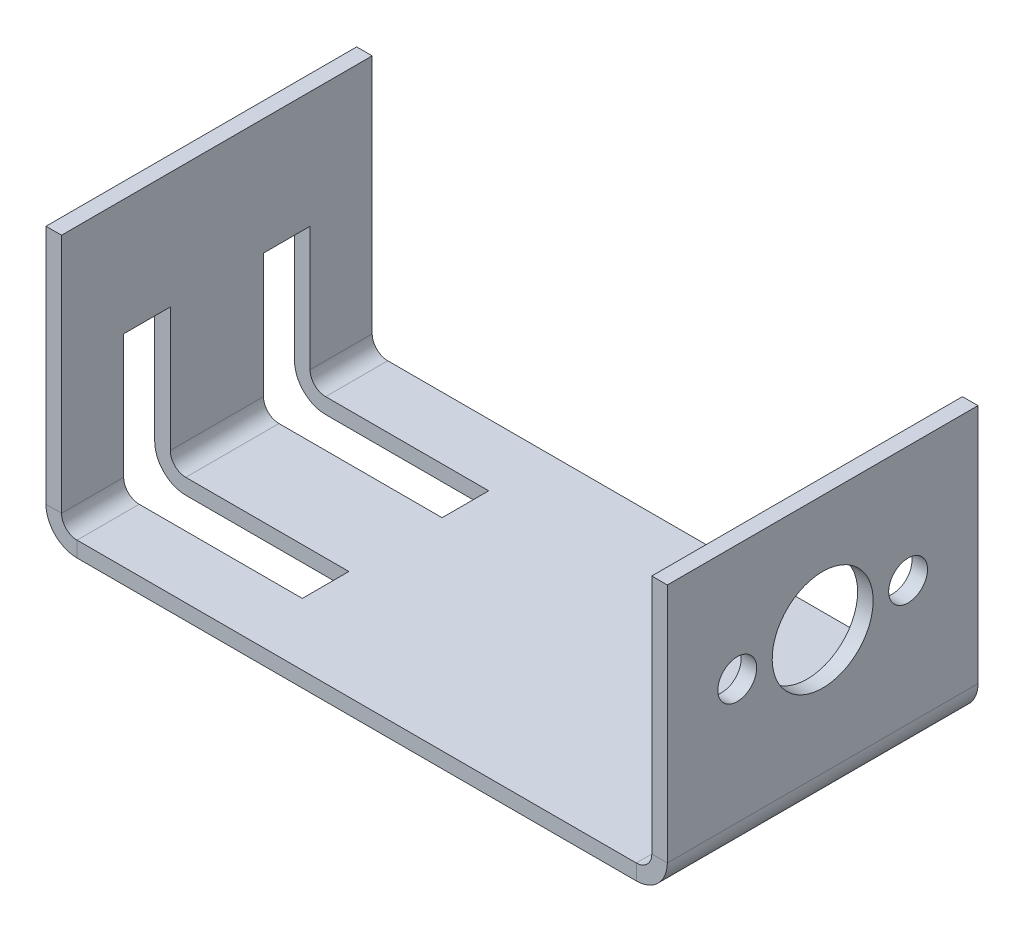
ISO-10303-21;
HEADER;
FILE_DESCRIPTION(('STEP AP214'),'2;1');
FILE_NAME('part.step','',(''),(''),'','','');
FILE_SCHEMA(('AUTOMOTIVE_DESIGN { 1 0 10303 214 1 1 1 1 }'));
ENDSEC;
DATA;
#1=APPLICATION_CONTEXT('core data for automotive mechanical design processes');
#2=APPLICATION_PROTOCOL_DEFINITION('international standard','automotive_design',2000,#1);
#3=PRODUCT_CONTEXT('',#1,'mechanical');
#4=PRODUCT('Part','Part','',(#3));
#5=PRODUCT_RELATED_PRODUCT_CATEGORY('part','',(#4));
#6=PRODUCT_DEFINITION_FORMATION('','',#4);
#7=PRODUCT_DEFINITION_CONTEXT('part definition',#1,'design');
#8=PRODUCT_DEFINITION('design','',#6,#7);
#9=PRODUCT_DEFINITION_SHAPE('','',#8);
#10=(LENGTH_UNIT() NAMED_UNIT(*) SI_UNIT(.MILLI.,.METRE.));
#11=(NAMED_UNIT(*) PLANE_ANGLE_UNIT() SI_UNIT($,.RADIAN.));
#12=(NAMED_UNIT(*) SI_UNIT($,.STERADIAN.) SOLID_ANGLE_UNIT());
#13=UNCERTAINTY_MEASURE_WITH_UNIT(LENGTH_MEASURE(1.E-05),#10,'distance_accuracy_value','');
#14=(GEOMETRIC_REPRESENTATION_CONTEXT(3) GLOBAL_UNCERTAINTY_ASSIGNED_CONTEXT((#13)) GLOBAL_UNIT_ASSIGNED_CONTEXT((#10,
#11,#12)) REPRESENTATION_CONTEXT('',''));
#15=CARTESIAN_POINT('',(0.,0.,0.));
#16=DIRECTION('',(0.,0.,1.));
#17=DIRECTION('',(1.,0.,0.));
#18=AXIS2_PLACEMENT_3D('',#15,#16,#17);
#19=CARTESIAN_POINT('',(-36.,2.,20.));
#20=DIRECTION('',(0.,0.,1.));
#21=DIRECTION('',(-1.,0.,0.));
#22=AXIS2_PLACEMENT_3D('',#19,#20,#21);
#23=CYLINDRICAL_SURFACE('',#22,4.);
#24=CARTESIAN_POINT('',(-36.,2.,12.));
#25=DIRECTION('',(0.,0.,1.));
#26=DIRECTION('',(1.,0.,0.));
#27=AXIS2_PLACEMENT_3D('',#24,#25,#26);
#28=CIRCLE('',#27,4.);
#29=CARTESIAN_POINT('',(-36.,-2.,12.));
#30=VERTEX_POINT('',#29);
#31=CARTESIAN_POINT('',(-40.,1.99999999999999,12.));
#32=VERTEX_POINT('',#31);
#33=EDGE_CURVE('E349',#30,#32,#28,.F.);
#34=ORIENTED_EDGE('',*,*,#33,.F.);
#35=DIRECTION('',(0.,0.,1.));
#36=VECTOR('',#35,1.);
#37=CARTESIAN_POINT('',(-36.,-2.,20.));
#38=LINE('',#37,#36);
#39=CARTESIAN_POINT('',(-36.,-2.,20.));
#40=VERTEX_POINT('',#39);
#41=EDGE_CURVE('E458',#40,#30,#38,.F.);
#42=ORIENTED_EDGE('',*,*,#41,.F.);
#43=CARTESIAN_POINT('',(-36.,2.,20.));
#44=DIRECTION('',(0.,0.,1.));
#45=DIRECTION('',(1.,0.,0.));
#46=AXIS2_PLACEMENT_3D('',#43,#44,#45);
#47=CIRCLE('',#46,4.);
#48=CARTESIAN_POINT('',(-40.,1.99999999999999,20.));
#49=VERTEX_POINT('',#48);
#50=EDGE_CURVE('E467',#49,#40,#47,.T.);
#51=ORIENTED_EDGE('',*,*,#50,.F.);
#52=DIRECTION('',(0.,0.,1.));
#53=VECTOR('',#52,1.);
#54=CARTESIAN_POINT('',(-40.,1.99999999999999,-20.));
#55=LINE('',#54,#53);
#56=EDGE_CURVE('E444',#49,#32,#55,.F.);
#57=ORIENTED_EDGE('',*,*,#56,.T.);
#58=EDGE_LOOP('',(#34,#42,#51,#57));
#59=FACE_BOUND('',#58,.T.);
#60=ADVANCED_FACE('F83',(#59),#23,.T.);
#61=CARTESIAN_POINT('',(-36.,2.,6.));
#62=DIRECTION('',(0.,0.,-1.));
#63=DIRECTION('',(-1.,0.,0.));
#64=AXIS2_PLACEMENT_3D('',#61,#62,#63);
#65=CIRCLE('',#64,4.);
#66=CARTESIAN_POINT('',(-40.,1.99999999999999,6.));
#67=VERTEX_POINT('',#66);
#68=CARTESIAN_POINT('',(-36.,-2.,6.));
#69=VERTEX_POINT('',#68);
#70=EDGE_CURVE('E339',#67,#69,#65,.F.);
#71=ORIENTED_EDGE('',*,*,#70,.F.);
#72=CARTESIAN_POINT('',(-40.,1.99999999999999,-6.));
#73=VERTEX_POINT('',#72);
#74=EDGE_CURVE('E290',#67,#73,#55,.F.);
#75=ORIENTED_EDGE('',*,*,#74,.T.);
#76=CARTESIAN_POINT('',(-36.,2.,-6.));
#77=DIRECTION('',(0.,0.,1.));
#78=DIRECTION('',(1.,0.,0.));
#79=AXIS2_PLACEMENT_3D('',#76,#77,#78);
#80=CIRCLE('',#79,4.);
#81=CARTESIAN_POINT('',(-36.,-2.,-6.));
#82=VERTEX_POINT('',#81);
#83=EDGE_CURVE('E329',#82,#73,#80,.F.);
#84=ORIENTED_EDGE('',*,*,#83,.F.);
#85=EDGE_CURVE('E462',#69,#82,#38,.F.);
#86=ORIENTED_EDGE('',*,*,#85,.F.);
#87=EDGE_LOOP('',(#71,#75,#84,#86));
#88=FACE_BOUND('',#87,.T.);
#89=ADVANCED_FACE('F600',(#88),#23,.T.);
#90=CARTESIAN_POINT('',(-36.,2.,20.));
#91=DIRECTION('',(0.,0.,1.));
#92=DIRECTION('',(-1.,0.,0.));
#93=AXIS2_PLACEMENT_3D('',#90,#91,#92);
#94=CYLINDRICAL_SURFACE('',#93,2.);
#95=DIRECTION('',(0.,0.,1.));
#96=VECTOR('',#95,1.);
#97=CARTESIAN_POINT('',(-36.,0.,20.));
#98=LINE('',#97,#96);
#99=CARTESIAN_POINT('',(-36.,0.,20.));
#100=VERTEX_POINT('',#99);
#101=CARTESIAN_POINT('',(-36.,0.,12.));
#102=VERTEX_POINT('',#101);
#103=EDGE_CURVE('E473',#100,#102,#98,.F.);
#104=ORIENTED_EDGE('',*,*,#103,.T.);
#105=CARTESIAN_POINT('',(-36.,2.,12.));
#106=DIRECTION('',(0.,0.,1.));
#107=DIRECTION('',(1.,0.,0.));
#108=AXIS2_PLACEMENT_3D('',#105,#106,#107);
#109=CIRCLE('',#108,2.);
#110=CARTESIAN_POINT('',(-38.,1.99999999999999,12.));
#111=VERTEX_POINT('',#110);
#112=EDGE_CURVE('E343',#102,#111,#109,.F.);
#113=ORIENTED_EDGE('',*,*,#112,.T.);
#114=DIRECTION('',(0.,0.,1.));
#115=VECTOR('',#114,1.);
#116=CARTESIAN_POINT('',(-38.,1.99999999999999,-20.));
#117=LINE('',#116,#115);
#118=CARTESIAN_POINT('',(-38.,1.99999999999999,20.));
#119=VERTEX_POINT('',#118);
#120=EDGE_CURVE('E455',#111,#119,#117,.T.);
#121=ORIENTED_EDGE('',*,*,#120,.T.);
#122=CARTESIAN_POINT('',(-36.,2.,20.));
#123=DIRECTION('',(0.,0.,1.));
#124=DIRECTION('',(1.,0.,0.));
#125=AXIS2_PLACEMENT_3D('',#122,#123,#124);
#126=CIRCLE('',#125,2.);
#127=EDGE_CURVE('E426',#119,#100,#126,.T.);
#128=ORIENTED_EDGE('',*,*,#127,.T.);
#129=EDGE_LOOP('',(#104,#113,#121,#128));
#130=FACE_BOUND('',#129,.T.);
#131=ADVANCED_FACE('F549',(#130),#94,.F.);
#132=CARTESIAN_POINT('',(-38.,1.99999999999999,-6.));
#133=VERTEX_POINT('',#132);
#134=CARTESIAN_POINT('',(-38.,1.99999999999999,6.));
#135=VERTEX_POINT('',#134);
#136=EDGE_CURVE('E454',#133,#135,#117,.T.);
#137=ORIENTED_EDGE('',*,*,#136,.T.);
#138=CARTESIAN_POINT('',(-36.,2.,6.));
#139=DIRECTION('',(0.,0.,-1.));
#140=DIRECTION('',(-1.,0.,0.));
#141=AXIS2_PLACEMENT_3D('',#138,#139,#140);
#142=CIRCLE('',#141,2.);
#143=CARTESIAN_POINT('',(-36.,0.,6.));
#144=VERTEX_POINT('',#143);
#145=EDGE_CURVE('E333',#135,#144,#142,.F.);
#146=ORIENTED_EDGE('',*,*,#145,.T.);
#147=CARTESIAN_POINT('',(-36.,0.,-6.));
#148=VERTEX_POINT('',#147);
#149=EDGE_CURVE('E476',#144,#148,#98,.F.);
#150=ORIENTED_EDGE('',*,*,#149,.T.);
#151=CARTESIAN_POINT('',(-36.,2.,-6.));
#152=DIRECTION('',(0.,0.,1.));
#153=DIRECTION('',(1.,0.,0.));
#154=AXIS2_PLACEMENT_3D('',#151,#152,#153);
#155=CIRCLE('',#154,2.);
#156=EDGE_CURVE('E323',#148,#133,#155,.F.);
#157=ORIENTED_EDGE('',*,*,#156,.T.);
#158=EDGE_LOOP('',(#137,#146,#150,#157));
#159=FACE_BOUND('',#158,.T.);
#160=ADVANCED_FACE('F535',(#159),#94,.F.);
#161=CARTESIAN_POINT('',(0.,-2.,0.));
#162=DIRECTION('',(0.,-1.,0.));
#163=DIRECTION('',(0.,0.,-1.));
#164=AXIS2_PLACEMENT_3D('',#161,#162,#163);
#165=PLANE('',#164);
#166=DIRECTION('',(-1.,0.,0.));
#167=VECTOR('',#166,1.);
#168=CARTESIAN_POINT('',(0.,-2.,12.));
#169=LINE('',#168,#167);
#170=CARTESIAN_POINT('',(-15.,-2.,12.));
#171=VERTEX_POINT('',#170);
#172=EDGE_CURVE('E351',#171,#30,#169,.T.);
#173=ORIENTED_EDGE('',*,*,#172,.F.);
#174=DIRECTION('',(0.,0.,1.));
#175=VECTOR('',#174,1.);
#176=CARTESIAN_POINT('',(-15.,-2.,0.));
#177=LINE('',#176,#175);
#178=CARTESIAN_POINT('',(-15.,-2.,6.));
#179=VERTEX_POINT('',#178);
#180=EDGE_CURVE('E356',#179,#171,#177,.T.);
#181=ORIENTED_EDGE('',*,*,#180,.F.);
#182=DIRECTION('',(1.,0.,0.));
#183=VECTOR('',#182,1.);
#184=CARTESIAN_POINT('',(0.,-2.,6.));
#185=LINE('',#184,#183);
#186=EDGE_CURVE('E341',#69,#179,#185,.T.);
#187=ORIENTED_EDGE('',*,*,#186,.F.);
#188=ORIENTED_EDGE('',*,*,#85,.T.);
#189=DIRECTION('',(-1.,0.,0.));
#190=VECTOR('',#189,1.);
#191=CARTESIAN_POINT('',(0.,-2.,-6.));
#192=LINE('',#191,#190);
#193=CARTESIAN_POINT('',(-15.,-2.,-6.));
#194=VERTEX_POINT('',#193);
#195=EDGE_CURVE('E331',#194,#82,#192,.T.);
#196=ORIENTED_EDGE('',*,*,#195,.F.);
#197=DIRECTION('',(0.,0.,-1.));
#198=VECTOR('',#197,1.);
#199=CARTESIAN_POINT('',(-15.,-2.,0.));
#200=LINE('',#199,#198);
#201=CARTESIAN_POINT('',(-15.,-2.,-12.));
#202=VERTEX_POINT('',#201);
#203=EDGE_CURVE('E353',#194,#202,#200,.T.);
#204=ORIENTED_EDGE('',*,*,#203,.T.);
#205=DIRECTION('',(1.,0.,0.));
#206=VECTOR('',#205,1.);
#207=CARTESIAN_POINT('',(0.,-2.,-12.));
#208=LINE('',#207,#206);
#209=CARTESIAN_POINT('',(-36.,-2.,-12.));
#210=VERTEX_POINT('',#209);
#211=EDGE_CURVE('E321',#210,#202,#208,.T.);
#212=ORIENTED_EDGE('',*,*,#211,.F.);
#213=CARTESIAN_POINT('',(-36.,-2.,-20.));
#214=VERTEX_POINT('',#213);
#215=EDGE_CURVE('E463',#210,#214,#38,.F.);
#216=ORIENTED_EDGE('',*,*,#215,.T.);
#217=DIRECTION('',(-1.,0.,0.));
#218=VECTOR('',#217,1.);
#219=CARTESIAN_POINT('',(40.,-2.,-20.));
#220=LINE('',#219,#218);
#221=CARTESIAN_POINT('',(36.,-2.00000000000001,-20.));
#222=VERTEX_POINT('',#221);
#223=EDGE_CURVE('E489',#222,#214,#220,.T.);
#224=ORIENTED_EDGE('',*,*,#223,.F.);
#225=DIRECTION('',(0.,0.,-1.));
#226=VECTOR('',#225,1.);
#227=CARTESIAN_POINT('',(36.,-2.00000000000001,-20.));
#228=LINE('',#227,#226);
#229=CARTESIAN_POINT('',(36.,-2.,20.));
#230=VERTEX_POINT('',#229);
#231=EDGE_CURVE('E400',#222,#230,#228,.F.);
#232=ORIENTED_EDGE('',*,*,#231,.T.);
#233=DIRECTION('',(1.,0.,0.));
#234=VECTOR('',#233,1.);
#235=CARTESIAN_POINT('',(40.,-2.,20.));
#236=LINE('',#235,#234);
#237=EDGE_CURVE('E486',#40,#230,#236,.T.);
#238=ORIENTED_EDGE('',*,*,#237,.F.);
#239=ORIENTED_EDGE('',*,*,#41,.T.);
#240=EDGE_LOOP('',(#173,#181,#187,#188,#196,#204,#212,#216,#224,#232,#238,#239));
#241=FACE_BOUND('',#240,.T.);
#242=ADVANCED_FACE('F580',(#241),#165,.T.);
#243=CARTESIAN_POINT('',(0.,0.,0.));
#244=DIRECTION('',(0.,-1.,0.));
#245=DIRECTION('',(0.,0.,-1.));
#246=AXIS2_PLACEMENT_3D('',#243,#244,#245);
#247=PLANE('',#246);
#248=DIRECTION('',(0.,0.,1.));
#249=VECTOR('',#248,1.);
#250=CARTESIAN_POINT('',(-15.,0.,0.));
#251=LINE('',#250,#249);
#252=CARTESIAN_POINT('',(-15.,0.,6.));
#253=VERTEX_POINT('',#252);
#254=CARTESIAN_POINT('',(-15.,0.,12.));
#255=VERTEX_POINT('',#254);
#256=EDGE_CURVE('E13',#253,#255,#251,.T.);
#257=ORIENTED_EDGE('',*,*,#256,.T.);
#258=DIRECTION('',(-1.,0.,0.));
#259=VECTOR('',#258,1.);
#260=CARTESIAN_POINT('',(0.,0.,12.));
#261=LINE('',#260,#259);
#262=EDGE_CURVE('E346',#255,#102,#261,.T.);
#263=ORIENTED_EDGE('',*,*,#262,.T.);
#264=ORIENTED_EDGE('',*,*,#103,.F.);
#265=DIRECTION('',(1.,0.,0.));
#266=VECTOR('',#265,1.);
#267=CARTESIAN_POINT('',(40.,0.,20.));
#268=LINE('',#267,#266);
#269=CARTESIAN_POINT('',(36.,0.,20.));
#270=VERTEX_POINT('',#269);
#271=EDGE_CURVE('E483',#100,#270,#268,.T.);
#272=ORIENTED_EDGE('',*,*,#271,.T.);
#273=DIRECTION('',(0.,0.,-1.));
#274=VECTOR('',#273,1.);
#275=CARTESIAN_POINT('',(36.,0.,-20.));
#276=LINE('',#275,#274);
#277=CARTESIAN_POINT('',(36.,0.,-20.));
#278=VERTEX_POINT('',#277);
#279=EDGE_CURVE('E413',#278,#270,#276,.F.);
#280=ORIENTED_EDGE('',*,*,#279,.F.);
#281=DIRECTION('',(-1.,0.,0.));
#282=VECTOR('',#281,1.);
#283=CARTESIAN_POINT('',(40.,0.,-20.));
#284=LINE('',#283,#282);
#285=CARTESIAN_POINT('',(-36.,0.,-20.));
#286=VERTEX_POINT('',#285);
#287=EDGE_CURVE('E490',#278,#286,#284,.T.);
#288=ORIENTED_EDGE('',*,*,#287,.T.);
#289=CARTESIAN_POINT('',(-36.,0.,-12.));
#290=VERTEX_POINT('',#289);
#291=EDGE_CURVE('E477',#290,#286,#98,.F.);
#292=ORIENTED_EDGE('',*,*,#291,.F.);
#293=DIRECTION('',(1.,0.,0.));
#294=VECTOR('',#293,1.);
#295=CARTESIAN_POINT('',(0.,0.,-12.));
#296=LINE('',#295,#294);
#297=CARTESIAN_POINT('',(-15.,0.,-12.));
#298=VERTEX_POINT('',#297);
#299=EDGE_CURVE('E316',#290,#298,#296,.T.);
#300=ORIENTED_EDGE('',*,*,#299,.T.);
#301=DIRECTION('',(0.,0.,-1.));
#302=VECTOR('',#301,1.);
#303=CARTESIAN_POINT('',(-15.,0.,0.));
#304=LINE('',#303,#302);
#305=CARTESIAN_POINT('',(-15.,0.,-6.));
#306=VERTEX_POINT('',#305);
#307=EDGE_CURVE('E91',#306,#298,#304,.T.);
#308=ORIENTED_EDGE('',*,*,#307,.F.);
#309=DIRECTION('',(-1.,0.,0.));
#310=VECTOR('',#309,1.);
#311=CARTESIAN_POINT('',(0.,0.,-6.));
#312=LINE('',#311,#310);
#313=EDGE_CURVE('E326',#306,#148,#312,.T.);
#314=ORIENTED_EDGE('',*,*,#313,.T.);
#315=ORIENTED_EDGE('',*,*,#149,.F.);
#316=DIRECTION('',(1.,0.,0.));
#317=VECTOR('',#316,1.);
#318=CARTESIAN_POINT('',(0.,0.,6.));
#319=LINE('',#318,#317);
#320=EDGE_CURVE('E336',#144,#253,#319,.T.);
#321=ORIENTED_EDGE('',*,*,#320,.T.);
#322=EDGE_LOOP('',(#257,#263,#264,#272,#280,#288,#292,#300,#308,#314,#315,#321));
#323=FACE_BOUND('',#322,.T.);
#324=ADVANCED_FACE('F525',(#323),#247,.F.);
#325=CARTESIAN_POINT('',(40.,-2.,-20.));
#326=DIRECTION('',(0.,0.,-1.));
#327=DIRECTION('',(-1.,0.,0.));
#328=AXIS2_PLACEMENT_3D('',#325,#326,#327);
#329=PLANE('',#328);
#330=ORIENTED_EDGE('',*,*,#287,.F.);
#331=DIRECTION('',(0.,-1.,0.));
#332=VECTOR('',#331,1.);
#333=CARTESIAN_POINT('',(36.,0.,-20.));
#334=LINE('',#333,#332);
#335=EDGE_CURVE('E407',#278,#222,#334,.T.);
#336=ORIENTED_EDGE('',*,*,#335,.T.);
#337=ORIENTED_EDGE('',*,*,#223,.T.);
#338=DIRECTION('',(0.,-1.,0.));
#339=VECTOR('',#338,1.);
#340=CARTESIAN_POINT('',(-36.,0.,-20.));
#341=LINE('',#340,#339);
#342=EDGE_CURVE('E480',#286,#214,#341,.T.);
#343=ORIENTED_EDGE('',*,*,#342,.F.);
#344=EDGE_LOOP('',(#330,#336,#337,#343));
#345=FACE_BOUND('',#344,.T.);
#346=ADVANCED_FACE('F590',(#345),#329,.T.);
#347=CARTESIAN_POINT('',(40.,-2.,20.));
#348=DIRECTION('',(0.,0.,1.));
#349=DIRECTION('',(1.,0.,0.));
#350=AXIS2_PLACEMENT_3D('',#347,#348,#349);
#351=PLANE('',#350);
#352=DIRECTION('',(0.,-1.,0.));
#353=VECTOR('',#352,1.);
#354=CARTESIAN_POINT('',(36.,0.,20.));
#355=LINE('',#354,#353);
#356=EDGE_CURVE('E417',#270,#230,#355,.T.);
#357=ORIENTED_EDGE('',*,*,#356,.F.);
#358=ORIENTED_EDGE('',*,*,#271,.F.);
#359=DIRECTION('',(0.,-1.,0.));
#360=VECTOR('',#359,1.);
#361=CARTESIAN_POINT('',(-36.,0.,20.));
#362=LINE('',#361,#360);
#363=EDGE_CURVE('E466',#100,#40,#362,.T.);
#364=ORIENTED_EDGE('',*,*,#363,.T.);
#365=ORIENTED_EDGE('',*,*,#237,.T.);
#366=EDGE_LOOP('',(#357,#358,#364,#365));
#367=FACE_BOUND('',#366,.T.);
#368=ADVANCED_FACE('F85',(#367),#351,.T.);
#369=CARTESIAN_POINT('',(-36.,2.,-20.));
#370=DIRECTION('',(0.,0.,-1.));
#371=DIRECTION('',(-1.,0.,0.));
#372=AXIS2_PLACEMENT_3D('',#369,#370,#371);
#373=PLANE('',#372);
#374=DIRECTION('',(1.,0.,0.));
#375=VECTOR('',#374,1.);
#376=CARTESIAN_POINT('',(-40.,1.99999999999999,-20.));
#377=LINE('',#376,#375);
#378=CARTESIAN_POINT('',(-38.,1.99999999999999,-20.));
#379=VERTEX_POINT('',#378);
#380=CARTESIAN_POINT('',(-40.,1.99999999999999,-20.));
#381=VERTEX_POINT('',#380);
#382=EDGE_CURVE('E420',#379,#381,#377,.F.);
#383=ORIENTED_EDGE('',*,*,#382,.F.);
#384=CARTESIAN_POINT('',(-36.,2.,-20.));
#385=DIRECTION('',(0.,0.,1.));
#386=DIRECTION('',(1.,0.,0.));
#387=AXIS2_PLACEMENT_3D('',#384,#385,#386);
#388=CIRCLE('',#387,2.);
#389=EDGE_CURVE('E470',#286,#379,#388,.F.);
#390=ORIENTED_EDGE('',*,*,#389,.F.);
#391=ORIENTED_EDGE('',*,*,#342,.T.);
#392=CARTESIAN_POINT('',(-36.,2.,-20.));
#393=DIRECTION('',(0.,0.,1.));
#394=DIRECTION('',(1.,0.,0.));
#395=AXIS2_PLACEMENT_3D('',#392,#393,#394);
#396=CIRCLE('',#395,4.);
#397=EDGE_CURVE('E461',#214,#381,#396,.F.);
#398=ORIENTED_EDGE('',*,*,#397,.T.);
#399=EDGE_LOOP('',(#383,#390,#391,#398));
#400=FACE_BOUND('',#399,.T.);
#401=ADVANCED_FACE('F592',(#400),#373,.T.);
#402=CARTESIAN_POINT('',(-36.,2.,20.));
#403=DIRECTION('',(0.,0.,-1.));
#404=DIRECTION('',(-1.,0.,0.));
#405=AXIS2_PLACEMENT_3D('',#402,#403,#404);
#406=PLANE('',#405);
#407=ORIENTED_EDGE('',*,*,#127,.F.);
#408=DIRECTION('',(1.,0.,0.));
#409=VECTOR('',#408,1.);
#410=CARTESIAN_POINT('',(-38.,1.99999999999999,20.));
#411=LINE('',#410,#409);
#412=EDGE_CURVE('E448',#119,#49,#411,.F.);
#413=ORIENTED_EDGE('',*,*,#412,.T.);
#414=ORIENTED_EDGE('',*,*,#50,.T.);
#415=ORIENTED_EDGE('',*,*,#363,.F.);
#416=EDGE_LOOP('',(#407,#413,#414,#415));
#417=FACE_BOUND('',#416,.T.);
#418=ADVANCED_FACE('F554',(#417),#406,.F.);
#419=CARTESIAN_POINT('',(-36.,2.,-12.));
#420=DIRECTION('',(0.,0.,-1.));
#421=DIRECTION('',(-1.,0.,0.));
#422=AXIS2_PLACEMENT_3D('',#419,#420,#421);
#423=CIRCLE('',#422,4.);
#424=CARTESIAN_POINT('',(-40.,1.99999999999999,-12.));
#425=VERTEX_POINT('',#424);
#426=EDGE_CURVE('E319',#425,#210,#423,.F.);
#427=ORIENTED_EDGE('',*,*,#426,.F.);
#428=EDGE_CURVE('E447',#425,#381,#55,.F.);
#429=ORIENTED_EDGE('',*,*,#428,.T.);
#430=ORIENTED_EDGE('',*,*,#397,.F.);
#431=ORIENTED_EDGE('',*,*,#215,.F.);
#432=EDGE_LOOP('',(#427,#429,#430,#431));
#433=FACE_BOUND('',#432,.T.);
#434=ADVANCED_FACE('F604',(#433),#23,.T.);
#435=CARTESIAN_POINT('',(-38.,1.99999999999999,-12.));
#436=VERTEX_POINT('',#435);
#437=EDGE_CURVE('E451',#379,#436,#117,.T.);
#438=ORIENTED_EDGE('',*,*,#437,.T.);
#439=CARTESIAN_POINT('',(-36.,2.,-12.));
#440=DIRECTION('',(0.,0.,-1.));
#441=DIRECTION('',(-1.,0.,0.));
#442=AXIS2_PLACEMENT_3D('',#439,#440,#441);
#443=CIRCLE('',#442,2.);
#444=EDGE_CURVE('E277',#436,#290,#443,.F.);
#445=ORIENTED_EDGE('',*,*,#444,.T.);
#446=ORIENTED_EDGE('',*,*,#291,.T.);
#447=ORIENTED_EDGE('',*,*,#389,.T.);
#448=EDGE_LOOP('',(#438,#445,#446,#447));
#449=FACE_BOUND('',#448,.T.);
#450=ADVANCED_FACE('F594',(#449),#94,.F.);
#451=CARTESIAN_POINT('',(-40.0000000000001,33.,20.));
#452=DIRECTION('',(0.,0.,-1.));
#453=DIRECTION('',(-1.,0.,0.));
#454=AXIS2_PLACEMENT_3D('',#451,#452,#453);
#455=PLANE('',#454);
#456=ORIENTED_EDGE('',*,*,#412,.F.);
#457=DIRECTION('',(0.,-1.,0.));
#458=VECTOR('',#457,1.);
#459=CARTESIAN_POINT('',(-38.0000000000001,33.,20.));
#460=LINE('',#459,#458);
#461=CARTESIAN_POINT('',(-38.0000000000001,33.,20.));
#462=VERTEX_POINT('',#461);
#463=EDGE_CURVE('E442',#119,#462,#460,.F.);
#464=ORIENTED_EDGE('',*,*,#463,.T.);
#465=DIRECTION('',(1.,0.,0.));
#466=VECTOR('',#465,1.);
#467=CARTESIAN_POINT('',(-40.0000000000001,33.,20.));
#468=LINE('',#467,#466);
#469=CARTESIAN_POINT('',(-40.0000000000001,33.,20.));
#470=VERTEX_POINT('',#469);
#471=EDGE_CURVE('E423',#470,#462,#468,.T.);
#472=ORIENTED_EDGE('',*,*,#471,.F.);
#473=DIRECTION('',(0.,1.,0.));
#474=VECTOR('',#473,1.);
#475=CARTESIAN_POINT('',(-40.,-1.49966231000623E-13,20.));
#476=LINE('',#475,#474);
#477=EDGE_CURVE('E435',#49,#470,#476,.T.);
#478=ORIENTED_EDGE('',*,*,#477,.F.);
#479=EDGE_LOOP('',(#456,#464,#472,#478));
#480=FACE_BOUND('',#479,.T.);
#481=ADVANCED_FACE('F558',(#480),#455,.F.);
#482=CARTESIAN_POINT('',(-40.,0.,-20.));
#483=DIRECTION('',(0.,0.,1.));
#484=DIRECTION('',(1.,0.,0.));
#485=AXIS2_PLACEMENT_3D('',#482,#483,#484);
#486=PLANE('',#485);
#487=ORIENTED_EDGE('',*,*,#382,.T.);
#488=DIRECTION('',(0.,-1.,0.));
#489=VECTOR('',#488,1.);
#490=CARTESIAN_POINT('',(-40.,-1.49966231000623E-13,-20.));
#491=LINE('',#490,#489);
#492=CARTESIAN_POINT('',(-40.0000000000001,33.,-20.));
#493=VERTEX_POINT('',#492);
#494=EDGE_CURVE('E430',#493,#381,#491,.T.);
#495=ORIENTED_EDGE('',*,*,#494,.F.);
#496=DIRECTION('',(1.,0.,0.));
#497=VECTOR('',#496,1.);
#498=CARTESIAN_POINT('',(-40.0000000000001,33.,-20.));
#499=LINE('',#498,#497);
#500=CARTESIAN_POINT('',(-38.0000000000001,33.,-20.));
#501=VERTEX_POINT('',#500);
#502=EDGE_CURVE('E427',#493,#501,#499,.T.);
#503=ORIENTED_EDGE('',*,*,#502,.T.);
#504=DIRECTION('',(0.,1.,0.));
#505=VECTOR('',#504,1.);
#506=CARTESIAN_POINT('',(-38.,0.,-20.));
#507=LINE('',#506,#505);
#508=EDGE_CURVE('E437',#501,#379,#507,.F.);
#509=ORIENTED_EDGE('',*,*,#508,.T.);
#510=EDGE_LOOP('',(#487,#495,#503,#509));
#511=FACE_BOUND('',#510,.T.);
#512=ADVANCED_FACE('F569',(#511),#486,.F.);
#513=CARTESIAN_POINT('',(-40.,-1.49966231000623E-13,0.));
#514=DIRECTION('',(1.,0.,0.));
#515=DIRECTION('',(0.,1.,0.));
#516=AXIS2_PLACEMENT_3D('',#513,#514,#515);
#517=PLANE('',#516);
#518=DIRECTION('',(0.,0.,-1.));
#519=VECTOR('',#518,1.);
#520=CARTESIAN_POINT('',(-40.0000000000001,18.,6.));
#521=LINE('',#520,#519);
#522=CARTESIAN_POINT('',(-40.0000000000001,18.,12.));
#523=VERTEX_POINT('',#522);
#524=CARTESIAN_POINT('',(-40.0000000000001,18.,6.));
#525=VERTEX_POINT('',#524);
#526=EDGE_CURVE('E280',#523,#525,#521,.T.);
#527=ORIENTED_EDGE('',*,*,#526,.F.);
#528=DIRECTION('',(0.,1.,0.));
#529=VECTOR('',#528,1.);
#530=CARTESIAN_POINT('',(-39.9999999999999,-22.,12.));
#531=LINE('',#530,#529);
#532=EDGE_CURVE('E284',#32,#523,#531,.T.);
#533=ORIENTED_EDGE('',*,*,#532,.F.);
#534=ORIENTED_EDGE('',*,*,#56,.F.);
#535=ORIENTED_EDGE('',*,*,#477,.T.);
#536=DIRECTION('',(0.,0.,-1.));
#537=VECTOR('',#536,1.);
#538=CARTESIAN_POINT('',(-40.0000000000001,33.,0.));
#539=LINE('',#538,#537);
#540=EDGE_CURVE('E433',#470,#493,#539,.T.);
#541=ORIENTED_EDGE('',*,*,#540,.T.);
#542=ORIENTED_EDGE('',*,*,#494,.T.);
#543=ORIENTED_EDGE('',*,*,#428,.F.);
#544=DIRECTION('',(0.,-1.,0.));
#545=VECTOR('',#544,1.);
#546=CARTESIAN_POINT('',(-39.9999999999999,-22.,-12.));
#547=LINE('',#546,#545);
#548=CARTESIAN_POINT('',(-40.0000000000001,18.,-12.));
#549=VERTEX_POINT('',#548);
#550=EDGE_CURVE('E303',#549,#425,#547,.T.);
#551=ORIENTED_EDGE('',*,*,#550,.F.);
#552=DIRECTION('',(0.,0.,-1.));
#553=VECTOR('',#552,1.);
#554=CARTESIAN_POINT('',(-40.0000000000001,18.,-6.));
#555=LINE('',#554,#553);
#556=CARTESIAN_POINT('',(-40.0000000000001,18.,-6.));
#557=VERTEX_POINT('',#556);
#558=EDGE_CURVE('E305',#557,#549,#555,.T.);
#559=ORIENTED_EDGE('',*,*,#558,.F.);
#560=DIRECTION('',(0.,1.,0.));
#561=VECTOR('',#560,1.);
#562=CARTESIAN_POINT('',(-39.9999999999999,-22.,-6.));
#563=LINE('',#562,#561);
#564=EDGE_CURVE('E308',#73,#557,#563,.T.);
#565=ORIENTED_EDGE('',*,*,#564,.F.);
#566=ORIENTED_EDGE('',*,*,#74,.F.);
#567=DIRECTION('',(0.,-1.,0.));
#568=VECTOR('',#567,1.);
#569=CARTESIAN_POINT('',(-39.9999999999999,-22.,6.));
#570=LINE('',#569,#568);
#571=EDGE_CURVE('E272',#525,#67,#570,.T.);
#572=ORIENTED_EDGE('',*,*,#571,.F.);
#573=EDGE_LOOP('',(#527,#533,#534,#535,#541,#542,#543,#551,#559,#565,#566,#572));
#574=FACE_BOUND('',#573,.T.);
#575=ADVANCED_FACE('F287',(#574),#517,.F.);
#576=CARTESIAN_POINT('',(-38.,-1.42983268322937E-13,0.));
#577=DIRECTION('',(1.,0.,0.));
#578=DIRECTION('',(0.,1.,0.));
#579=AXIS2_PLACEMENT_3D('',#576,#577,#578);
#580=PLANE('',#579);
#581=DIRECTION('',(0.,-1.,0.));
#582=VECTOR('',#581,1.);
#583=CARTESIAN_POINT('',(-38.,-1.42983268322937E-13,12.));
#584=LINE('',#583,#582);
#585=CARTESIAN_POINT('',(-38.0000000000001,18.,12.));
#586=VERTEX_POINT('',#585);
#587=EDGE_CURVE('E514',#586,#111,#584,.T.);
#588=ORIENTED_EDGE('',*,*,#587,.F.);
#589=DIRECTION('',(0.,0.,1.));
#590=VECTOR('',#589,1.);
#591=CARTESIAN_POINT('',(-38.0000000000001,18.,0.));
#592=LINE('',#591,#590);
#593=CARTESIAN_POINT('',(-38.0000000000001,18.,6.));
#594=VERTEX_POINT('',#593);
#595=EDGE_CURVE('E511',#594,#586,#592,.T.);
#596=ORIENTED_EDGE('',*,*,#595,.F.);
#597=DIRECTION('',(0.,1.,0.));
#598=VECTOR('',#597,1.);
#599=CARTESIAN_POINT('',(-38.,-1.42983268322937E-13,6.));
#600=LINE('',#599,#598);
#601=EDGE_CURVE('E275',#135,#594,#600,.T.);
#602=ORIENTED_EDGE('',*,*,#601,.F.);
#603=ORIENTED_EDGE('',*,*,#136,.F.);
#604=DIRECTION('',(0.,-1.,0.));
#605=VECTOR('',#604,1.);
#606=CARTESIAN_POINT('',(-38.,-1.42983268322937E-13,-6.));
#607=LINE('',#606,#605);
#608=CARTESIAN_POINT('',(-38.0000000000001,18.,-6.));
#609=VERTEX_POINT('',#608);
#610=EDGE_CURVE('E509',#609,#133,#607,.T.);
#611=ORIENTED_EDGE('',*,*,#610,.F.);
#612=DIRECTION('',(0.,0.,1.));
#613=VECTOR('',#612,1.);
#614=CARTESIAN_POINT('',(-38.0000000000001,18.,0.));
#615=LINE('',#614,#613);
#616=CARTESIAN_POINT('',(-38.0000000000001,18.,-12.));
#617=VERTEX_POINT('',#616);
#618=EDGE_CURVE('E493',#617,#609,#615,.T.);
#619=ORIENTED_EDGE('',*,*,#618,.F.);
#620=DIRECTION('',(0.,1.,0.));
#621=VECTOR('',#620,1.);
#622=CARTESIAN_POINT('',(-38.,-1.42983268322937E-13,-12.));
#623=LINE('',#622,#621);
#624=EDGE_CURVE('E506',#436,#617,#623,.T.);
#625=ORIENTED_EDGE('',*,*,#624,.F.);
#626=ORIENTED_EDGE('',*,*,#437,.F.);
#627=ORIENTED_EDGE('',*,*,#508,.F.);
#628=DIRECTION('',(0.,0.,1.));
#629=VECTOR('',#628,1.);
#630=CARTESIAN_POINT('',(-38.0000000000001,33.,-20.));
#631=LINE('',#630,#629);
#632=EDGE_CURVE('E440',#462,#501,#631,.F.);
#633=ORIENTED_EDGE('',*,*,#632,.F.);
#634=ORIENTED_EDGE('',*,*,#463,.F.);
#635=ORIENTED_EDGE('',*,*,#120,.F.);
#636=EDGE_LOOP('',(#588,#596,#602,#603,#611,#619,#625,#626,#627,#633,#634,#635));
#637=FACE_BOUND('',#636,.T.);
#638=ADVANCED_FACE('F544',(#637),#580,.T.);
#639=CARTESIAN_POINT('',(-40.0000000000001,33.,-20.));
#640=DIRECTION('',(0.,-1.,0.));
#641=DIRECTION('',(1.,0.,0.));
#642=AXIS2_PLACEMENT_3D('',#639,#640,#641);
#643=PLANE('',#642);
#644=ORIENTED_EDGE('',*,*,#632,.T.);
#645=ORIENTED_EDGE('',*,*,#502,.F.);
#646=ORIENTED_EDGE('',*,*,#540,.F.);
#647=ORIENTED_EDGE('',*,*,#471,.T.);
#648=EDGE_LOOP('',(#644,#645,#646,#647));
#649=FACE_BOUND('',#648,.T.);
#650=ADVANCED_FACE('F565',(#649),#643,.F.);
#651=CARTESIAN_POINT('',(36.,2.,20.));
#652=DIRECTION('',(0.,0.,1.));
#653=DIRECTION('',(0.,-1.,0.));
#654=AXIS2_PLACEMENT_3D('',#651,#652,#653);
#655=PLANE('',#654);
#656=DIRECTION('',(-1.,0.,0.));
#657=VECTOR('',#656,1.);
#658=CARTESIAN_POINT('',(40.,1.99999999999999,20.));
#659=LINE('',#658,#657);
#660=CARTESIAN_POINT('',(38.,1.99999999999999,20.));
#661=VERTEX_POINT('',#660);
#662=CARTESIAN_POINT('',(40.,1.99999999999999,20.));
#663=VERTEX_POINT('',#662);
#664=EDGE_CURVE('E396',#661,#663,#659,.F.);
#665=ORIENTED_EDGE('',*,*,#664,.F.);
#666=CARTESIAN_POINT('',(36.,2.,20.));
#667=DIRECTION('',(0.,0.,-1.));
#668=DIRECTION('',(0.,1.,0.));
#669=AXIS2_PLACEMENT_3D('',#666,#667,#668);
#670=CIRCLE('',#669,2.00000000000001);
#671=EDGE_CURVE('E410',#270,#661,#670,.F.);
#672=ORIENTED_EDGE('',*,*,#671,.F.);
#673=ORIENTED_EDGE('',*,*,#356,.T.);
#674=CARTESIAN_POINT('',(36.,2.,20.));
#675=DIRECTION('',(0.,0.,-1.));
#676=DIRECTION('',(0.,1.,0.));
#677=AXIS2_PLACEMENT_3D('',#674,#675,#676);
#678=CIRCLE('',#677,4.00000000000001);
#679=EDGE_CURVE('E403',#230,#663,#678,.F.);
#680=ORIENTED_EDGE('',*,*,#679,.T.);
#681=EDGE_LOOP('',(#665,#672,#673,#680));
#682=FACE_BOUND('',#681,.T.);
#683=ADVANCED_FACE('F621',(#682),#655,.T.);
#684=CARTESIAN_POINT('',(36.,2.,-20.));
#685=DIRECTION('',(0.,0.,1.));
#686=DIRECTION('',(0.,-1.,0.));
#687=AXIS2_PLACEMENT_3D('',#684,#685,#686);
#688=PLANE('',#687);
#689=CARTESIAN_POINT('',(36.,2.,-20.));
#690=DIRECTION('',(0.,0.,-1.));
#691=DIRECTION('',(0.,1.,0.));
#692=AXIS2_PLACEMENT_3D('',#689,#690,#691);
#693=CIRCLE('',#692,2.00000000000001);
#694=CARTESIAN_POINT('',(38.,1.99999999999999,-20.));
#695=VERTEX_POINT('',#694);
#696=EDGE_CURVE('E371',#695,#278,#693,.T.);
#697=ORIENTED_EDGE('',*,*,#696,.F.);
#698=DIRECTION('',(-1.,0.,0.));
#699=VECTOR('',#698,1.);
#700=CARTESIAN_POINT('',(38.,1.99999999999999,-20.));
#701=LINE('',#700,#699);
#702=CARTESIAN_POINT('',(40.,1.99999999999998,-20.));
#703=VERTEX_POINT('',#702);
#704=EDGE_CURVE('E391',#695,#703,#701,.F.);
#705=ORIENTED_EDGE('',*,*,#704,.T.);
#706=CARTESIAN_POINT('',(36.,2.,-20.));
#707=DIRECTION('',(0.,0.,-1.));
#708=DIRECTION('',(0.,1.,0.));
#709=AXIS2_PLACEMENT_3D('',#706,#707,#708);
#710=CIRCLE('',#709,4.00000000000001);
#711=EDGE_CURVE('E404',#703,#222,#710,.T.);
#712=ORIENTED_EDGE('',*,*,#711,.T.);
#713=ORIENTED_EDGE('',*,*,#335,.F.);
#714=EDGE_LOOP('',(#697,#705,#712,#713));
#715=FACE_BOUND('',#714,.T.);
#716=ADVANCED_FACE('F586',(#715),#688,.F.);
#717=CARTESIAN_POINT('',(36.,2.,-20.));
#718=DIRECTION('',(0.,0.,-1.));
#719=DIRECTION('',(1.,0.,0.));
#720=AXIS2_PLACEMENT_3D('',#717,#718,#719);
#721=CYLINDRICAL_SURFACE('',#720,4.00000000000001);
#722=ORIENTED_EDGE('',*,*,#231,.F.);
#723=ORIENTED_EDGE('',*,*,#711,.F.);
#724=DIRECTION('',(0.,0.,-1.));
#725=VECTOR('',#724,1.);
#726=CARTESIAN_POINT('',(40.,1.99999999999999,20.));
#727=LINE('',#726,#725);
#728=EDGE_CURVE('E389',#703,#663,#727,.F.);
#729=ORIENTED_EDGE('',*,*,#728,.T.);
#730=ORIENTED_EDGE('',*,*,#679,.F.);
#731=EDGE_LOOP('',(#722,#723,#729,#730));
#732=FACE_BOUND('',#731,.T.);
#733=ADVANCED_FACE('F583',(#732),#721,.T.);
#734=CARTESIAN_POINT('',(36.,2.,-20.));
#735=DIRECTION('',(0.,0.,-1.));
#736=DIRECTION('',(1.,0.,0.));
#737=AXIS2_PLACEMENT_3D('',#734,#735,#736);
#738=CYLINDRICAL_SURFACE('',#737,2.00000000000001);
#739=ORIENTED_EDGE('',*,*,#279,.T.);
#740=ORIENTED_EDGE('',*,*,#671,.T.);
#741=DIRECTION('',(0.,0.,-1.));
#742=VECTOR('',#741,1.);
#743=CARTESIAN_POINT('',(38.,1.99999999999999,20.));
#744=LINE('',#743,#742);
#745=EDGE_CURVE('E394',#661,#695,#744,.T.);
#746=ORIENTED_EDGE('',*,*,#745,.T.);
#747=ORIENTED_EDGE('',*,*,#696,.T.);
#748=EDGE_LOOP('',(#739,#740,#746,#747));
#749=FACE_BOUND('',#748,.T.);
#750=ADVANCED_FACE('F618',(#749),#738,.F.);
#751=CARTESIAN_POINT('',(40.,0.,20.));
#752=DIRECTION('',(0.,0.,-1.));
#753=DIRECTION('',(-1.,0.,0.));
#754=AXIS2_PLACEMENT_3D('',#751,#752,#753);
#755=PLANE('',#754);
#756=ORIENTED_EDGE('',*,*,#664,.T.);
#757=DIRECTION('',(0.,-1.,0.));
#758=VECTOR('',#757,1.);
#759=CARTESIAN_POINT('',(40.,-1.41555450511039E-13,20.));
#760=LINE('',#759,#758);
#761=CARTESIAN_POINT('',(40.0000000000001,33.,20.));
#762=VERTEX_POINT('',#761);
#763=EDGE_CURVE('E379',#762,#663,#760,.T.);
#764=ORIENTED_EDGE('',*,*,#763,.F.);
#765=DIRECTION('',(-1.,0.,0.));
#766=VECTOR('',#765,1.);
#767=CARTESIAN_POINT('',(40.0000000000001,33.,20.));
#768=LINE('',#767,#766);
#769=CARTESIAN_POINT('',(38.0000000000001,33.,20.));
#770=VERTEX_POINT('',#769);
#771=EDGE_CURVE('E372',#762,#770,#768,.T.);
#772=ORIENTED_EDGE('',*,*,#771,.T.);
#773=DIRECTION('',(0.,1.,0.));
#774=VECTOR('',#773,1.);
#775=CARTESIAN_POINT('',(38.,0.,20.));
#776=LINE('',#775,#774);
#777=EDGE_CURVE('E386',#770,#661,#776,.F.);
#778=ORIENTED_EDGE('',*,*,#777,.T.);
#779=EDGE_LOOP('',(#756,#764,#772,#778));
#780=FACE_BOUND('',#779,.T.);
#781=ADVANCED_FACE('F624',(#780),#755,.F.);
#782=CARTESIAN_POINT('',(40.0000000000001,33.,-20.));
#783=DIRECTION('',(0.,0.,1.));
#784=DIRECTION('',(1.,0.,0.));
#785=AXIS2_PLACEMENT_3D('',#782,#783,#784);
#786=PLANE('',#785);
#787=ORIENTED_EDGE('',*,*,#704,.F.);
#788=DIRECTION('',(0.,-1.,0.));
#789=VECTOR('',#788,1.);
#790=CARTESIAN_POINT('',(38.0000000000001,33.,-20.));
#791=LINE('',#790,#789);
#792=CARTESIAN_POINT('',(38.0000000000001,33.,-20.));
#793=VERTEX_POINT('',#792);
#794=EDGE_CURVE('E384',#695,#793,#791,.F.);
#795=ORIENTED_EDGE('',*,*,#794,.T.);
#796=DIRECTION('',(-1.,0.,0.));
#797=VECTOR('',#796,1.);
#798=CARTESIAN_POINT('',(40.0000000000001,33.,-20.));
#799=LINE('',#798,#797);
#800=CARTESIAN_POINT('',(40.0000000000001,33.,-20.));
#801=VERTEX_POINT('',#800);
#802=EDGE_CURVE('E368',#801,#793,#799,.T.);
#803=ORIENTED_EDGE('',*,*,#802,.F.);
#804=DIRECTION('',(0.,1.,0.));
#805=VECTOR('',#804,1.);
#806=CARTESIAN_POINT('',(40.,-1.41555450511039E-13,-20.));
#807=LINE('',#806,#805);
#808=EDGE_CURVE('E377',#703,#801,#807,.T.);
#809=ORIENTED_EDGE('',*,*,#808,.F.);
#810=EDGE_LOOP('',(#787,#795,#803,#809));
#811=FACE_BOUND('',#810,.T.);
#812=ADVANCED_FACE('F639',(#811),#786,.F.);
#813=CARTESIAN_POINT('',(40.,-1.41555450511039E-13,0.));
#814=DIRECTION('',(-1.,0.,0.));
#815=DIRECTION('',(0.,-1.,0.));
#816=AXIS2_PLACEMENT_3D('',#813,#814,#815);
#817=PLANE('',#816);
#818=CARTESIAN_POINT('',(40.,18.,-11.));
#819=DIRECTION('',(1.,0.,0.));
#820=DIRECTION('',(0.,-1.,0.));
#821=AXIS2_PLACEMENT_3D('',#818,#819,#820);
#822=CIRCLE('',#821,2.5);
#823=CARTESIAN_POINT('',(40.,15.5,-11.));
#824=VERTEX_POINT('',#823);
#825=EDGE_CURVE('E358',#824,#824,#822,.T.);
#826=ORIENTED_EDGE('',*,*,#825,.F.);
#827=EDGE_LOOP('',(#826));
#828=FACE_BOUND('',#827,.T.);
#829=CARTESIAN_POINT('',(40.0000000000001,18.,11.));
#830=DIRECTION('',(1.,0.,0.));
#831=DIRECTION('',(0.,1.,0.));
#832=AXIS2_PLACEMENT_3D('',#829,#830,#831);
#833=CIRCLE('',#832,2.5);
#834=CARTESIAN_POINT('',(40.0000000000001,20.5,11.));
#835=VERTEX_POINT('',#834);
#836=EDGE_CURVE('E359',#835,#835,#833,.T.);
#837=ORIENTED_EDGE('',*,*,#836,.F.);
#838=EDGE_LOOP('',(#837));
#839=FACE_BOUND('',#838,.T.);
#840=CARTESIAN_POINT('',(40.0000000000001,18.,0.));
#841=DIRECTION('',(1.,0.,0.));
#842=DIRECTION('',(0.,1.,0.));
#843=AXIS2_PLACEMENT_3D('',#840,#841,#842);
#844=CIRCLE('',#843,6.5);
#845=CARTESIAN_POINT('',(40.0000000000001,24.5,0.));
#846=VERTEX_POINT('',#845);
#847=EDGE_CURVE('E362',#846,#846,#844,.T.);
#848=ORIENTED_EDGE('',*,*,#847,.F.);
#849=EDGE_LOOP('',(#848));
#850=FACE_BOUND('',#849,.T.);
#851=ORIENTED_EDGE('',*,*,#728,.F.);
#852=ORIENTED_EDGE('',*,*,#808,.T.);
#853=DIRECTION('',(0.,0.,1.));
#854=VECTOR('',#853,1.);
#855=CARTESIAN_POINT('',(40.0000000000001,33.,0.));
#856=LINE('',#855,#854);
#857=EDGE_CURVE('E375',#801,#762,#856,.T.);
#858=ORIENTED_EDGE('',*,*,#857,.T.);
#859=ORIENTED_EDGE('',*,*,#763,.T.);
#860=EDGE_LOOP('',(#851,#852,#858,#859));
#861=FACE_BOUND('',#860,.T.);
#862=ADVANCED_FACE('F627',(#828,#839,#850,#861),#817,.F.);
#863=CARTESIAN_POINT('',(38.,-1.34572487833352E-13,0.));
#864=DIRECTION('',(-1.,0.,0.));
#865=DIRECTION('',(0.,-1.,0.));
#866=AXIS2_PLACEMENT_3D('',#863,#864,#865);
#867=PLANE('',#866);
#868=CARTESIAN_POINT('',(38.,18.,-11.));
#869=DIRECTION('',(-1.,0.,0.));
#870=DIRECTION('',(0.,-1.,0.));
#871=AXIS2_PLACEMENT_3D('',#868,#869,#870);
#872=CIRCLE('',#871,2.5);
#873=CARTESIAN_POINT('',(38.,15.5,-11.));
#874=VERTEX_POINT('',#873);
#875=EDGE_CURVE('E399',#874,#874,#872,.T.);
#876=ORIENTED_EDGE('',*,*,#875,.F.);
#877=EDGE_LOOP('',(#876));
#878=FACE_BOUND('',#877,.T.);
#879=CARTESIAN_POINT('',(38.0000000000001,18.,11.));
#880=DIRECTION('',(-1.,0.,0.));
#881=DIRECTION('',(0.,-1.,0.));
#882=AXIS2_PLACEMENT_3D('',#879,#880,#881);
#883=CIRCLE('',#882,2.5);
#884=CARTESIAN_POINT('',(38.,15.5,11.));
#885=VERTEX_POINT('',#884);
#886=EDGE_CURVE('E500',#885,#885,#883,.T.);
#887=ORIENTED_EDGE('',*,*,#886,.F.);
#888=EDGE_LOOP('',(#887));
#889=FACE_BOUND('',#888,.T.);
#890=CARTESIAN_POINT('',(38.0000000000001,18.,0.));
#891=DIRECTION('',(-1.,0.,0.));
#892=DIRECTION('',(0.,-1.,0.));
#893=AXIS2_PLACEMENT_3D('',#890,#891,#892);
#894=CIRCLE('',#893,6.5);
#895=CARTESIAN_POINT('',(38.,11.5,0.));
#896=VERTEX_POINT('',#895);
#897=EDGE_CURVE('E367',#896,#896,#894,.T.);
#898=ORIENTED_EDGE('',*,*,#897,.F.);
#899=EDGE_LOOP('',(#898));
#900=FACE_BOUND('',#899,.T.);
#901=ORIENTED_EDGE('',*,*,#794,.F.);
#902=ORIENTED_EDGE('',*,*,#745,.F.);
#903=ORIENTED_EDGE('',*,*,#777,.F.);
#904=DIRECTION('',(0.,0.,-1.));
#905=VECTOR('',#904,1.);
#906=CARTESIAN_POINT('',(38.0000000000001,33.,20.));
#907=LINE('',#906,#905);
#908=EDGE_CURVE('E382',#793,#770,#907,.F.);
#909=ORIENTED_EDGE('',*,*,#908,.F.);
#910=EDGE_LOOP('',(#901,#902,#903,#909));
#911=FACE_BOUND('',#910,.T.);
#912=ADVANCED_FACE('F637',(#878,#889,#900,#911),#867,.T.);
#913=CARTESIAN_POINT('',(40.0000000000001,33.,20.));
#914=DIRECTION('',(0.,-1.,0.));
#915=DIRECTION('',(1.,0.,0.));
#916=AXIS2_PLACEMENT_3D('',#913,#914,#915);
#917=PLANE('',#916);
#918=ORIENTED_EDGE('',*,*,#908,.T.);
#919=ORIENTED_EDGE('',*,*,#771,.F.);
#920=ORIENTED_EDGE('',*,*,#857,.F.);
#921=ORIENTED_EDGE('',*,*,#802,.T.);
#922=EDGE_LOOP('',(#918,#919,#920,#921));
#923=FACE_BOUND('',#922,.T.);
#924=ADVANCED_FACE('F633',(#923),#917,.F.);
#925=CARTESIAN_POINT('',(30.0000000000001,18.,0.));
#926=DIRECTION('',(1.,0.,0.));
#927=DIRECTION('',(0.,1.,0.));
#928=AXIS2_PLACEMENT_3D('',#925,#926,#927);
#929=CYLINDRICAL_SURFACE('',#928,6.5);
#930=ORIENTED_EDGE('',*,*,#897,.T.);
#931=EDGE_LOOP('',(#930));
#932=FACE_BOUND('',#931,.T.);
#933=ORIENTED_EDGE('',*,*,#847,.T.);
#934=EDGE_LOOP('',(#933));
#935=FACE_BOUND('',#934,.T.);
#936=ADVANCED_FACE('F778',(#932,#935),#929,.F.);
#937=CARTESIAN_POINT('',(30.0000000000001,18.,11.));
#938=DIRECTION('',(1.,0.,0.));
#939=DIRECTION('',(0.,1.,0.));
#940=AXIS2_PLACEMENT_3D('',#937,#938,#939);
#941=CYLINDRICAL_SURFACE('',#940,2.5);
#942=ORIENTED_EDGE('',*,*,#886,.T.);
#943=EDGE_LOOP('',(#942));
#944=FACE_BOUND('',#943,.T.);
#945=ORIENTED_EDGE('',*,*,#836,.T.);
#946=EDGE_LOOP('',(#945));
#947=FACE_BOUND('',#946,.T.);
#948=ADVANCED_FACE('F803',(#944,#947),#941,.F.);
#949=CARTESIAN_POINT('',(30.,18.,-11.));
#950=DIRECTION('',(1.,0.,0.));
#951=DIRECTION('',(0.,1.,0.));
#952=AXIS2_PLACEMENT_3D('',#949,#950,#951);
#953=CYLINDRICAL_SURFACE('',#952,2.5);
#954=ORIENTED_EDGE('',*,*,#875,.T.);
#955=EDGE_LOOP('',(#954));
#956=FACE_BOUND('',#955,.T.);
#957=ORIENTED_EDGE('',*,*,#825,.T.);
#958=EDGE_LOOP('',(#957));
#959=FACE_BOUND('',#958,.T.);
#960=ADVANCED_FACE('F814',(#956,#959),#953,.F.);
#961=CARTESIAN_POINT('',(-15.,0.,0.));
#962=DIRECTION('',(-1.,0.,0.));
#963=DIRECTION('',(0.,-1.,0.));
#964=AXIS2_PLACEMENT_3D('',#961,#962,#963);
#965=PLANE('',#964);
#966=DIRECTION('',(0.,1.,0.));
#967=VECTOR('',#966,1.);
#968=CARTESIAN_POINT('',(-14.9999999999999,-21.9999999999999,-6.));
#969=LINE('',#968,#967);
#970=EDGE_CURVE('E306',#194,#306,#969,.T.);
#971=ORIENTED_EDGE('',*,*,#970,.T.);
#972=ORIENTED_EDGE('',*,*,#307,.T.);
#973=DIRECTION('',(0.,-1.,0.));
#974=VECTOR('',#973,1.);
#975=CARTESIAN_POINT('',(-14.9999999999999,-21.9999999999999,-12.));
#976=LINE('',#975,#974);
#977=EDGE_CURVE('E300',#298,#202,#976,.T.);
#978=ORIENTED_EDGE('',*,*,#977,.T.);
#979=ORIENTED_EDGE('',*,*,#203,.F.);
#980=EDGE_LOOP('',(#971,#972,#978,#979));
#981=FACE_BOUND('',#980,.T.);
#982=ADVANCED_FACE('F518',(#981),#965,.T.);
#983=CARTESIAN_POINT('',(-14.9999999999999,-21.9999999999999,-6.));
#984=DIRECTION('',(0.,0.,1.));
#985=DIRECTION('',(1.,0.,0.));
#986=AXIS2_PLACEMENT_3D('',#983,#984,#985);
#987=PLANE('',#986);
#988=ORIENTED_EDGE('',*,*,#195,.T.);
#989=ORIENTED_EDGE('',*,*,#83,.T.);
#990=ORIENTED_EDGE('',*,*,#564,.T.);
#991=DIRECTION('',(-1.,0.,0.));
#992=VECTOR('',#991,1.);
#993=CARTESIAN_POINT('',(-15.0000000000001,18.0000000000001,-6.));
#994=LINE('',#993,#992);
#995=EDGE_CURVE('E106',#609,#557,#994,.T.);
#996=ORIENTED_EDGE('',*,*,#995,.F.);
#997=ORIENTED_EDGE('',*,*,#610,.T.);
#998=ORIENTED_EDGE('',*,*,#156,.F.);
#999=ORIENTED_EDGE('',*,*,#313,.F.);
#1000=ORIENTED_EDGE('',*,*,#970,.F.);
#1001=EDGE_LOOP('',(#988,#989,#990,#996,#997,#998,#999,#1000));
#1002=FACE_BOUND('',#1001,.T.);
#1003=ADVANCED_FACE('F538',(#1002),#987,.F.);
#1004=CARTESIAN_POINT('',(-14.9999999999999,-21.9999999999999,-12.));
#1005=DIRECTION('',(0.,0.,-1.));
#1006=DIRECTION('',(-1.,0.,0.));
#1007=AXIS2_PLACEMENT_3D('',#1004,#1005,#1006);
#1008=PLANE('',#1007);
#1009=ORIENTED_EDGE('',*,*,#211,.T.);
#1010=ORIENTED_EDGE('',*,*,#977,.F.);
#1011=ORIENTED_EDGE('',*,*,#299,.F.);
#1012=ORIENTED_EDGE('',*,*,#444,.F.);
#1013=ORIENTED_EDGE('',*,*,#624,.T.);
#1014=DIRECTION('',(-1.,0.,0.));
#1015=VECTOR('',#1014,1.);
#1016=CARTESIAN_POINT('',(-15.0000000000001,18.0000000000001,-12.));
#1017=LINE('',#1016,#1015);
#1018=EDGE_CURVE('E301',#617,#549,#1017,.T.);
#1019=ORIENTED_EDGE('',*,*,#1018,.T.);
#1020=ORIENTED_EDGE('',*,*,#550,.T.);
#1021=ORIENTED_EDGE('',*,*,#426,.T.);
#1022=EDGE_LOOP('',(#1009,#1010,#1011,#1012,#1013,#1019,#1020,#1021));
#1023=FACE_BOUND('',#1022,.T.);
#1024=ADVANCED_FACE('F522',(#1023),#1008,.F.);
#1025=CARTESIAN_POINT('',(-15.0000000000001,18.0000000000001,-6.));
#1026=DIRECTION('',(0.,1.,0.));
#1027=DIRECTION('',(-1.,0.,0.));
#1028=AXIS2_PLACEMENT_3D('',#1025,#1026,#1027);
#1029=PLANE('',#1028);
#1030=ORIENTED_EDGE('',*,*,#618,.T.);
#1031=ORIENTED_EDGE('',*,*,#995,.T.);
#1032=ORIENTED_EDGE('',*,*,#558,.T.);
#1033=ORIENTED_EDGE('',*,*,#1018,.F.);
#1034=EDGE_LOOP('',(#1030,#1031,#1032,#1033));
#1035=FACE_BOUND('',#1034,.T.);
#1036=ADVANCED_FACE('F597',(#1035),#1029,.F.);
#1037=CARTESIAN_POINT('',(-15.,0.,0.));
#1038=DIRECTION('',(1.,0.,0.));
#1039=DIRECTION('',(0.,1.,0.));
#1040=AXIS2_PLACEMENT_3D('',#1037,#1038,#1039);
#1041=PLANE('',#1040);
#1042=ORIENTED_EDGE('',*,*,#180,.T.);
#1043=DIRECTION('',(0.,1.,0.));
#1044=VECTOR('',#1043,1.);
#1045=CARTESIAN_POINT('',(-14.9999999999999,-21.9999999999999,12.));
#1046=LINE('',#1045,#1044);
#1047=EDGE_CURVE('E291',#171,#255,#1046,.T.);
#1048=ORIENTED_EDGE('',*,*,#1047,.T.);
#1049=ORIENTED_EDGE('',*,*,#256,.F.);
#1050=DIRECTION('',(0.,-1.,0.));
#1051=VECTOR('',#1050,1.);
#1052=CARTESIAN_POINT('',(-14.9999999999999,-21.9999999999999,6.));
#1053=LINE('',#1052,#1051);
#1054=EDGE_CURVE('E294',#253,#179,#1053,.T.);
#1055=ORIENTED_EDGE('',*,*,#1054,.T.);
#1056=EDGE_LOOP('',(#1042,#1048,#1049,#1055));
#1057=FACE_BOUND('',#1056,.T.);
#1058=ADVANCED_FACE('F611',(#1057),#1041,.F.);
#1059=CARTESIAN_POINT('',(-14.9999999999999,-21.9999999999999,12.));
#1060=DIRECTION('',(0.,0.,1.));
#1061=DIRECTION('',(1.,0.,0.));
#1062=AXIS2_PLACEMENT_3D('',#1059,#1060,#1061);
#1063=PLANE('',#1062);
#1064=ORIENTED_EDGE('',*,*,#172,.T.);
#1065=ORIENTED_EDGE('',*,*,#33,.T.);
#1066=ORIENTED_EDGE('',*,*,#532,.T.);
#1067=DIRECTION('',(-1.,0.,0.));
#1068=VECTOR('',#1067,1.);
#1069=CARTESIAN_POINT('',(-15.0000000000001,18.0000000000001,12.));
#1070=LINE('',#1069,#1068);
#1071=EDGE_CURVE('E98',#586,#523,#1070,.T.);
#1072=ORIENTED_EDGE('',*,*,#1071,.F.);
#1073=ORIENTED_EDGE('',*,*,#587,.T.);
#1074=ORIENTED_EDGE('',*,*,#112,.F.);
#1075=ORIENTED_EDGE('',*,*,#262,.F.);
#1076=ORIENTED_EDGE('',*,*,#1047,.F.);
#1077=EDGE_LOOP('',(#1064,#1065,#1066,#1072,#1073,#1074,#1075,#1076));
#1078=FACE_BOUND('',#1077,.T.);
#1079=ADVANCED_FACE('F615',(#1078),#1063,.F.);
#1080=CARTESIAN_POINT('',(-14.9999999999999,-21.9999999999999,6.));
#1081=DIRECTION('',(0.,0.,-1.));
#1082=DIRECTION('',(-1.,0.,0.));
#1083=AXIS2_PLACEMENT_3D('',#1080,#1081,#1082);
#1084=PLANE('',#1083);
#1085=ORIENTED_EDGE('',*,*,#186,.T.);
#1086=ORIENTED_EDGE('',*,*,#1054,.F.);
#1087=ORIENTED_EDGE('',*,*,#320,.F.);
#1088=ORIENTED_EDGE('',*,*,#145,.F.);
#1089=ORIENTED_EDGE('',*,*,#601,.T.);
#1090=DIRECTION('',(-1.,0.,0.));
#1091=VECTOR('',#1090,1.);
#1092=CARTESIAN_POINT('',(-15.0000000000001,18.0000000000001,6.));
#1093=LINE('',#1092,#1091);
#1094=EDGE_CURVE('E269',#594,#525,#1093,.T.);
#1095=ORIENTED_EDGE('',*,*,#1094,.T.);
#1096=ORIENTED_EDGE('',*,*,#571,.T.);
#1097=ORIENTED_EDGE('',*,*,#70,.T.);
#1098=EDGE_LOOP('',(#1085,#1086,#1087,#1088,#1089,#1095,#1096,#1097));
#1099=FACE_BOUND('',#1098,.T.);
#1100=ADVANCED_FACE('F270',(#1099),#1084,.F.);
#1101=CARTESIAN_POINT('',(-15.0000000000001,18.0000000000001,6.));
#1102=DIRECTION('',(0.,1.,0.));
#1103=DIRECTION('',(-1.,0.,0.));
#1104=AXIS2_PLACEMENT_3D('',#1101,#1102,#1103);
#1105=PLANE('',#1104);
#1106=ORIENTED_EDGE('',*,*,#595,.T.);
#1107=ORIENTED_EDGE('',*,*,#1071,.T.);
#1108=ORIENTED_EDGE('',*,*,#526,.T.);
#1109=ORIENTED_EDGE('',*,*,#1094,.F.);
#1110=EDGE_LOOP('',(#1106,#1107,#1108,#1109));
#1111=FACE_BOUND('',#1110,.T.);
#1112=ADVANCED_FACE('F281',(#1111),#1105,.F.);
#1113=CLOSED_SHELL('',(#60,#89,#131,#160,#242,#324,#346,#368,#401,#418,#434,#450,#481,#512,#575,
#638,#650,#683,#716,#733,#750,#781,#812,#862,#912,#924,#936,#948,#960,#982,#1003,#1024,#1036,
#1058,#1079,#1100,#1112));
#1114=MANIFOLD_SOLID_BREP('B2',#1113);
#1115=ADVANCED_BREP_SHAPE_REPRESENTATION('',(#18,#1114),#14);
#1116=SHAPE_DEFINITION_REPRESENTATION(#9,#1115);
ENDSEC;
END-ISO-10303-21;
